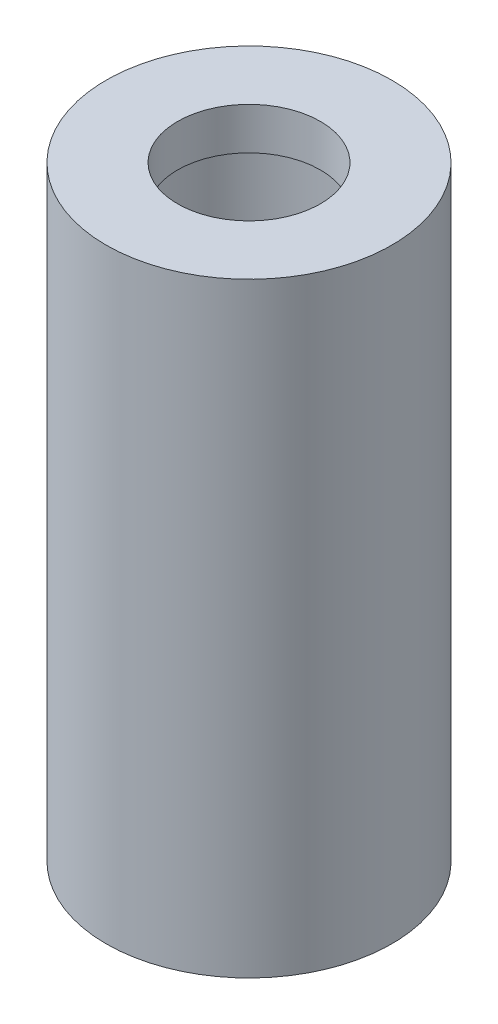
ISO-10303-21;
HEADER;
FILE_DESCRIPTION(('STEP AP214'),'2;1');
FILE_NAME('part.step','',(''),(''),'','','');
FILE_SCHEMA(('AUTOMOTIVE_DESIGN { 1 0 10303 214 1 1 1 1 }'));
ENDSEC;
DATA;
#1=APPLICATION_CONTEXT('core data for automotive mechanical design processes');
#2=APPLICATION_PROTOCOL_DEFINITION('international standard','automotive_design',2000,#1);
#3=PRODUCT_CONTEXT('',#1,'mechanical');
#4=PRODUCT('Part','Part','',(#3));
#5=PRODUCT_RELATED_PRODUCT_CATEGORY('part','',(#4));
#6=PRODUCT_DEFINITION_FORMATION('','',#4);
#7=PRODUCT_DEFINITION_CONTEXT('part definition',#1,'design');
#8=PRODUCT_DEFINITION('design','',#6,#7);
#9=PRODUCT_DEFINITION_SHAPE('','',#8);
#10=(LENGTH_UNIT() NAMED_UNIT(*) SI_UNIT(.MILLI.,.METRE.));
#11=(NAMED_UNIT(*) PLANE_ANGLE_UNIT() SI_UNIT($,.RADIAN.));
#12=(NAMED_UNIT(*) SI_UNIT($,.STERADIAN.) SOLID_ANGLE_UNIT());
#13=UNCERTAINTY_MEASURE_WITH_UNIT(LENGTH_MEASURE(1.E-05),#10,'distance_accuracy_value','');
#14=(GEOMETRIC_REPRESENTATION_CONTEXT(3) GLOBAL_UNCERTAINTY_ASSIGNED_CONTEXT((#13)) GLOBAL_UNIT_ASSIGNED_CONTEXT((#10,
#11,#12)) REPRESENTATION_CONTEXT('',''));
#15=CARTESIAN_POINT('',(0.,0.,0.));
#16=DIRECTION('',(0.,0.,1.));
#17=DIRECTION('',(1.,0.,0.));
#18=AXIS2_PLACEMENT_3D('',#15,#16,#17);
#19=CARTESIAN_POINT('',(0.,0.,0.));
#20=DIRECTION('',(0.,-1.,0.));
#21=DIRECTION('',(0.,0.,-1.));
#22=AXIS2_PLACEMENT_3D('',#19,#20,#21);
#23=CYLINDRICAL_SURFACE('',#22,4.318);
#24=CARTESIAN_POINT('',(0.,10.16,-4.318));
#25=CARTESIAN_POINT('',(0.107564996094003,10.1599939960877,-4.31799493700134));
#26=CARTESIAN_POINT('',(0.215280063258811,10.1514086647514,-4.31393656109449));
#27=CARTESIAN_POINT('',(0.427573036527433,10.1174252545205,-4.29810362143442));
#28=CARTESIAN_POINT('',(0.532143582591965,10.0919905222087,-4.28631223620757));
#29=CARTESIAN_POINT('',(0.734744660391047,10.0254975786058,-4.25625706788956));
#30=CARTESIAN_POINT('',(0.832797975199767,9.98449756788832,-4.23801741297071));
#31=CARTESIAN_POINT('',(1.02051085954431,9.88831627299821,-4.19677614463367));
#32=CARTESIAN_POINT('',(1.11017174440845,9.8331372161726,-4.17377527925105));
#33=CARTESIAN_POINT('',(1.28414734314053,9.70666633308327,-4.12367951380002));
#34=CARTESIAN_POINT('',(1.36789070455287,9.63465121864839,-4.09642839845823));
#35=CARTESIAN_POINT('',(1.52262602006949,9.47809677140521,-4.04147115133817));
#36=CARTESIAN_POINT('',(1.59360943141755,9.39354911668146,-4.01376472817753));
#37=CARTESIAN_POINT('',(1.72552717339445,9.20754818690793,-3.95892929484532));
#38=CARTESIAN_POINT('',(1.7854773720292,9.1053440102564,-3.93196163651535));
#39=CARTESIAN_POINT('',(1.88708667274111,8.89087705779825,-3.88422472935619));
#40=CARTESIAN_POINT('',(1.92875762400245,8.77862085503702,-3.86345146792904));
#41=CARTESIAN_POINT('',(1.99011493887881,8.55375286853101,-3.83219249604893));
#42=CARTESIAN_POINT('',(2.0109081250063,8.44151780447618,-3.82119290154902));
#43=CARTESIAN_POINT('',(2.03334173849922,8.2146560064079,-3.809307672583));
#44=CARTESIAN_POINT('',(2.03499751483782,8.10003126295059,-3.80841393282696));
#45=CARTESIAN_POINT('',(2.01992784930827,7.88429015104647,-3.81641935289164));
#46=CARTESIAN_POINT('',(2.00507628735512,7.78299745598531,-3.82432029483131));
#47=CARTESIAN_POINT('',(1.96062178676057,7.5845573925372,-3.84729849193661));
#48=CARTESIAN_POINT('',(1.93101496353401,7.48741112308625,-3.86237763684504));
#49=CARTESIAN_POINT('',(1.85731338514925,7.29730708472795,-3.89836102841066));
#50=CARTESIAN_POINT('',(1.81289931207698,7.20449820294967,-3.91939196254706));
#51=CARTESIAN_POINT('',(1.71107931588595,7.02723140048811,-3.96490068968397));
#52=CARTESIAN_POINT('',(1.65366768648658,6.94277717119627,-3.98937999482454));
#53=CARTESIAN_POINT('',(1.52005799065391,6.77478094662394,-4.04230824533155));
#54=CARTESIAN_POINT('',(1.4424842747245,6.69237339964082,-4.07089675776891));
#55=CARTESIAN_POINT('',(1.27443019166955,6.54129773258328,-4.12659504063025));
#56=CARTESIAN_POINT('',(1.18394496608462,6.47263480793559,-4.15370424907583));
#57=CARTESIAN_POINT('',(0.988371076162724,6.34866641538429,-4.20461802105592));
#58=CARTESIAN_POINT('',(0.882867703369781,6.29394511869164,-4.22826436758175));
#59=CARTESIAN_POINT('',(0.66275471125039,6.2034451135497,-4.26829654873372));
#60=CARTESIAN_POINT('',(0.548151592165333,6.16765302090504,-4.2846875120537));
#61=CARTESIAN_POINT('',(0.322456820120241,6.11868453218039,-4.30732135774457));
#62=CARTESIAN_POINT('',(0.211762078811778,6.10399381475204,-4.31424182912819));
#63=CARTESIAN_POINT('',(-0.0107221192577917,6.09298180188201,-4.31941782070158));
#64=CARTESIAN_POINT('',(-0.122511123429953,6.09665320770651,-4.31767678374325));
#65=CARTESIAN_POINT('',(-0.336094809160397,6.1212990069179,-4.30614070075398));
#66=CARTESIAN_POINT('',(-0.43805815964547,6.14110073726453,-4.29689163672836));
#67=CARTESIAN_POINT('',(-0.637044497748703,6.19568374466052,-4.27192685115026));
#68=CARTESIAN_POINT('',(-0.734066909602079,6.23046676302472,-4.25621037788311));
#69=CARTESIAN_POINT('',(-0.92380247385651,6.31506491914881,-4.21916418563295));
#70=CARTESIAN_POINT('',(-1.0162941223267,6.36530594786198,-4.19767796647096));
#71=CARTESIAN_POINT('',(-1.19186009927102,6.47892750923329,-4.15124717066001));
#72=CARTESIAN_POINT('',(-1.27493026814233,6.54231381089352,-4.12630107719029));
#73=CARTESIAN_POINT('',(-1.43711777415552,6.68697559250523,-4.07280523522967));
#74=CARTESIAN_POINT('',(-1.51522402110019,6.76934158054756,-4.04413241712159));
#75=CARTESIAN_POINT('',(-1.65690075820137,6.9462410539145,-3.98818483365197));
#76=CARTESIAN_POINT('',(-1.72046396650967,7.04078059780103,-3.96091077394251));
#77=CARTESIAN_POINT('',(-1.83321096410232,7.2435437273083,-3.91004187226364));
#78=CARTESIAN_POINT('',(-1.88182956558768,7.35212436950423,-3.88660448373372));
#79=CARTESIAN_POINT('',(-1.95959609474898,7.57739721965339,-3.84798954709838));
#80=CARTESIAN_POINT('',(-1.98876600180283,7.6940801057981,-3.8328026785154));
#81=CARTESIAN_POINT('',(-2.024365991721,7.92083761392558,-3.81410984107844));
#82=CARTESIAN_POINT('',(-2.03262361017406,8.03054753198225,-3.80966679169984));
#83=CARTESIAN_POINT('',(-2.03130337745915,8.2498131983759,-3.81037214759556));
#84=CARTESIAN_POINT('',(-2.02173079169853,8.35936898266883,-3.81551772127007));
#85=CARTESIAN_POINT('',(-1.98667636785656,8.56658082564855,-3.83387271773897));
#86=CARTESIAN_POINT('',(-1.96244724358528,8.66451161793325,-3.84644551756347));
#87=CARTESIAN_POINT('',(-1.90019105015951,8.85486537072883,-3.87757684186368));
#88=CARTESIAN_POINT('',(-1.8621598436195,8.94728667000263,-3.89613716100445));
#89=CARTESIAN_POINT('',(-1.77050985226195,9.13075913714984,-3.93867082597709));
#90=CARTESIAN_POINT('',(-1.7160226134899,9.2213103987938,-3.96292207747039));
#91=CARTESIAN_POINT('',(-1.59405430858161,9.39254599614916,-4.01353620723032));
#92=CARTESIAN_POINT('',(-1.52656707557385,9.47322561918205,-4.03990008419331));
#93=CARTESIAN_POINT('',(-1.37234993492437,9.6310179407821,-4.09501467747263));
#94=CARTESIAN_POINT('',(-1.28435545387417,9.70691277266711,-4.12373236567742));
#95=CARTESIAN_POINT('',(-1.09595464301873,9.84305441547222,-4.17775062508293));
#96=CARTESIAN_POINT('',(-0.995542378363646,9.90329370112545,-4.2030495501673));
#97=CARTESIAN_POINT('',(-0.785153159420695,10.005817249747,-4.24737171802493));
#98=CARTESIAN_POINT('',(-0.675217165362312,10.0481742116097,-4.26642029915691));
#99=CARTESIAN_POINT('',(-0.448797360372564,10.113294740842,-4.29611950060487));
#100=CARTESIAN_POINT('',(-0.332334044713147,10.1361163378388,-4.30679498516315));
#101=CARTESIAN_POINT('',(-0.179095685139983,10.152411814187,-4.31443390417931));
#102=CARTESIAN_POINT('',(-0.143354175924427,10.1552541950461,-4.31576842880261));
#103=CARTESIAN_POINT('',(-0.0717473461259999,10.1590493095224,-4.31755233062712));
#104=CARTESIAN_POINT('',(-0.0358820229172087,10.1600020028125,-4.31800168893823));
#105=CARTESIAN_POINT('',(0.,10.16,-4.318));
#106=B_SPLINE_CURVE_WITH_KNOTS('',3,(#24,#25,#26,#27,#28,#29,#30,#31,#32,#33,#34,#35,#36,#37,
#38,#39,#40,#41,#42,#43,#44,#45,#46,#47,#48,#49,#50,#51,#52,#53,#54,#55,#56,#57,#58,#59,#60,#61,
#62,#63,#64,#65,#66,#67,#68,#69,#70,#71,#72,#73,#74,#75,#76,#77,#78,#79,#80,#81,#82,#83,#84,#85,
#86,#87,#88,#89,#90,#91,#92,#93,#94,#95,#96,#97,#98,#99,#100,#101,#102,#103,#104,#105),
.UNSPECIFIED.,.T.,.F.,(4,2,2,2,2,2,2,2,2,2,2,2,2,2,2,2,2,2,2,2,2,2,2,2,2,2,2,2,2,2,2,2,2,2,2,2,
2,2,2,2,4),(0.,0.32254846684513,0.645800905144513,0.967856379231305,1.28986129341131,
1.62970508978123,1.96977557018109,2.33249495447047,2.69497886390578,3.0370303111089,
3.37880740022451,3.68541591861875,3.99210519983742,4.30588941064899,4.61981164933118,
4.96846138812248,5.31724266765533,5.67885210213351,6.04020551190461,6.37404842659705,
6.70775865310094,7.01916876990524,7.33061509250568,7.65155493667927,7.97263592936504,
8.32231521575717,8.67216920883114,9.03397074932527,9.39536271410128,9.7238728285382,
10.0522859465911,10.3559606668612,10.6597264935721,10.9836945797874,11.3078167285026,
11.6652357513411,12.0228262609809,12.3789486850412,12.7340095428163,12.8416044381476,
12.9492016296088),.UNSPECIFIED.);
#107=CARTESIAN_POINT('',(0.,10.16,-4.318));
#108=VERTEX_POINT('',#107);
#109=EDGE_CURVE('E73',#108,#108,#106,.T.);
#110=ORIENTED_EDGE('',*,*,#109,.F.);
#111=EDGE_LOOP('',(#110));
#112=FACE_BOUND('',#111,.T.);
#113=CARTESIAN_POINT('',(0.,18.288,0.));
#114=DIRECTION('',(0.,-1.,0.));
#115=DIRECTION('',(0.,0.,-1.));
#116=AXIS2_PLACEMENT_3D('',#113,#114,#115);
#117=CIRCLE('',#116,4.318);
#118=CARTESIAN_POINT('',(0.,18.288,-4.318));
#119=VERTEX_POINT('',#118);
#120=EDGE_CURVE('E70',#119,#119,#117,.T.);
#121=ORIENTED_EDGE('',*,*,#120,.T.);
#122=EDGE_LOOP('',(#121));
#123=FACE_BOUND('',#122,.T.);
#124=CARTESIAN_POINT('',(0.,0.,0.));
#125=DIRECTION('',(0.,-1.,0.));
#126=DIRECTION('',(0.,0.,-1.));
#127=AXIS2_PLACEMENT_3D('',#124,#125,#126);
#128=CIRCLE('',#127,4.318);
#129=CARTESIAN_POINT('',(0.,0.,-4.318));
#130=VERTEX_POINT('',#129);
#131=EDGE_CURVE('E10',#130,#130,#128,.T.);
#132=ORIENTED_EDGE('',*,*,#131,.F.);
#133=EDGE_LOOP('',(#132));
#134=FACE_BOUND('',#133,.T.);
#135=ADVANCED_FACE('F36',(#112,#123,#134),#23,.T.);
#136=CARTESIAN_POINT('',(3.175,0.,0.));
#137=DIRECTION('',(0.,-1.,0.));
#138=DIRECTION('',(0.,0.,-1.));
#139=AXIS2_PLACEMENT_3D('',#136,#137,#138);
#140=PLANE('',#139);
#141=ORIENTED_EDGE('',*,*,#131,.T.);
#142=EDGE_LOOP('',(#141));
#143=FACE_BOUND('',#142,.T.);
#144=CARTESIAN_POINT('',(0.,0.,0.));
#145=DIRECTION('',(0.,-1.,0.));
#146=DIRECTION('',(0.,0.,-1.));
#147=AXIS2_PLACEMENT_3D('',#144,#145,#146);
#148=CIRCLE('',#147,3.175);
#149=CARTESIAN_POINT('',(0.,0.,-3.175));
#150=VERTEX_POINT('',#149);
#151=EDGE_CURVE('E49',#150,#150,#148,.T.);
#152=ORIENTED_EDGE('',*,*,#151,.F.);
#153=EDGE_LOOP('',(#152));
#154=FACE_BOUND('',#153,.T.);
#155=ADVANCED_FACE('F106',(#143,#154),#140,.T.);
#156=CARTESIAN_POINT('',(0.,0.,0.));
#157=DIRECTION('',(0.,-1.,0.));
#158=DIRECTION('',(0.,0.,-1.));
#159=AXIS2_PLACEMENT_3D('',#156,#157,#158);
#160=CYLINDRICAL_SURFACE('',#159,3.175);
#161=CARTESIAN_POINT('',(0.,10.16,-3.175));
#162=CARTESIAN_POINT('',(-0.102802091998547,10.1599913633981,-3.17499204317214));
#163=CARTESIAN_POINT('',(-0.205712967083934,10.1521457873225,-3.16995556613701));
#164=CARTESIAN_POINT('',(-0.408345945914438,10.1211950960444,-3.15028428681525));
#165=CARTESIAN_POINT('',(-0.508062450647399,10.0980645764118,-3.13563350529892));
#166=CARTESIAN_POINT('',(-0.70099187155182,10.0379204585669,-3.09820061555947));
#167=CARTESIAN_POINT('',(-0.794234443207303,10.0009759080209,-3.07545897543814));
#168=CARTESIAN_POINT('',(-0.972850708349812,9.91473802420151,-3.02371392471125));
#169=CARTESIAN_POINT('',(-1.0582248651087,9.86544541858576,-2.99471088309727));
#170=CARTESIAN_POINT('',(-1.22657617751479,9.75148371501817,-2.93000295258297));
#171=CARTESIAN_POINT('',(-1.30878643385331,9.6858868427974,-2.89394397085769));
#172=CARTESIAN_POINT('',(-1.46177780864565,9.54333864805653,-2.81976531709181));
#173=CARTESIAN_POINT('',(-1.53254282535195,9.46637161553581,-2.7816428408765));
#174=CARTESIAN_POINT('',(-1.67097750324061,9.29038447212942,-2.70106343805628));
#175=CARTESIAN_POINT('',(-1.73674918752875,9.18978466519014,-2.65876858107147));
#176=CARTESIAN_POINT('',(-1.8502950828519,8.97650577978671,-2.58104184987292));
#177=CARTESIAN_POINT('',(-1.89810016623102,8.86384785308725,-2.5455982543951));
#178=CARTESIAN_POINT('',(-1.96306433169842,8.66046429639481,-2.4956381564288));
#179=CARTESIAN_POINT('',(-1.9850125820552,8.57202760489964,-2.47805527375041));
#180=CARTESIAN_POINT('',(-2.01688234158149,8.3917386678011,-2.45219187814505));
#181=CARTESIAN_POINT('',(-2.02682213142594,8.29989183379602,-2.4438972270032));
#182=CARTESIAN_POINT('',(-2.03406844238957,8.11505410651243,-2.43787169233307));
#183=CARTESIAN_POINT('',(-2.03133590853695,8.02206055854128,-2.44017346588101));
#184=CARTESIAN_POINT('',(-2.01334074881702,7.8381026586568,-2.45503753256747));
#185=CARTESIAN_POINT('',(-1.99806778439992,7.7471400446613,-2.46760829159312));
#186=CARTESIAN_POINT('',(-1.95654400964381,7.57229811014925,-2.50064563775483));
#187=CARTESIAN_POINT('',(-1.9306337193207,7.48828851150307,-2.52086589880531));
#188=CARTESIAN_POINT('',(-1.86892073645816,7.32567059288816,-2.56695150673926));
#189=CARTESIAN_POINT('',(-1.83311475787166,7.24706407795992,-2.59281872820029));
#190=CARTESIAN_POINT('',(-1.74468379478224,7.08131336100032,-2.65331736310943));
#191=CARTESIAN_POINT('',(-1.69014547028028,6.99545677503548,-2.68867632216134));
#192=CARTESIAN_POINT('',(-1.56927250704524,6.83313916380197,-2.76097453557637));
#193=CARTESIAN_POINT('',(-1.50292389187166,6.75668945404597,-2.79791562247838));
#194=CARTESIAN_POINT('',(-1.34609593842544,6.60111772627783,-2.87709972256472));
#195=CARTESIAN_POINT('',(-1.25342255447502,6.52405017917204,-2.91908129280469));
#196=CARTESIAN_POINT('',(-1.05412916945486,6.38660960949182,-2.99680453367646));
#197=CARTESIAN_POINT('',(-0.94752424885656,6.32621875184342,-3.03255285532205));
#198=CARTESIAN_POINT('',(-0.745027149764212,6.23492520177162,-3.08776548970284));
#199=CARTESIAN_POINT('',(-0.651197489087397,6.20055065629353,-3.1090528487167));
#200=CARTESIAN_POINT('',(-0.458101923285714,6.14577533612908,-3.14330309554202));
#201=CARTESIAN_POINT('',(-0.358840457318063,6.12536332941108,-3.15627267398738));
#202=CARTESIAN_POINT('',(-0.157245856062999,6.09953868029836,-3.17272053168039));
#203=CARTESIAN_POINT('',(-0.0549035728236163,6.09417633771128,-3.1761669816173));
#204=CARTESIAN_POINT('',(0.149278703587831,6.0989196104325,-3.17313166741519));
#205=CARTESIAN_POINT('',(0.25111866692885,6.10902613354727,-3.16664932059437));
#206=CARTESIAN_POINT('',(0.445777818959475,6.14316829751541,-3.14499563248384));
#207=CARTESIAN_POINT('',(0.538788771098942,6.16643504963934,-3.13030442711357));
#208=CARTESIAN_POINT('',(0.719347665233573,6.22521653048865,-3.09380938215554));
#209=CARTESIAN_POINT('',(0.806894685878681,6.2607333183098,-3.07200434684486));
#210=CARTESIAN_POINT('',(0.981221766727693,6.34577570321343,-3.02103940447064));
#211=CARTESIAN_POINT('',(1.06746270490706,6.39614534539221,-2.99145375338782));
#212=CARTESIAN_POINT('',(1.23068208252937,6.50804520937202,-2.92809272901181));
#213=CARTESIAN_POINT('',(1.3076532592485,6.5695840886868,-2.89431411212649));
#214=CARTESIAN_POINT('',(1.46249777618801,6.71276756104019,-2.81960831865929));
#215=CARTESIAN_POINT('',(1.53871535620921,6.79604730459113,-2.77837700931998));
#216=CARTESIAN_POINT('',(1.67667876113208,6.97452784822472,-2.69736409760926));
#217=CARTESIAN_POINT('',(1.73842174216536,7.06973098530492,-2.65758278141684));
#218=CARTESIAN_POINT('',(1.83860127108378,7.25721567173573,-2.58908117678437));
#219=CARTESIAN_POINT('',(1.87906802456759,7.3481247111273,-2.5595922960966));
#220=CARTESIAN_POINT('',(1.94668410344127,7.53684767352877,-2.50855535607173));
#221=CARTESIAN_POINT('',(1.9738519198636,7.63465179166822,-2.48699628145415));
#222=CARTESIAN_POINT('',(2.01355343863443,7.83604891585482,-2.45497691549338));
#223=CARTESIAN_POINT('',(2.02594703301665,7.93968773374163,-2.44462296914143));
#224=CARTESIAN_POINT('',(2.03456932369405,8.14807747312286,-2.43745721220956));
#225=CARTESIAN_POINT('',(2.03080975414351,8.25282753221585,-2.44063557133222));
#226=CARTESIAN_POINT('',(2.00920052708875,8.44433689683274,-2.45842888308435));
#227=CARTESIAN_POINT('',(1.99345832476193,8.53151435291493,-2.47133063315083));
#228=CARTESIAN_POINT('',(1.95129345000781,8.70174173100004,-2.50475552346759));
#229=CARTESIAN_POINT('',(1.92486018861993,8.78478746889456,-2.52528621816378));
#230=CARTESIAN_POINT('',(1.85150505892116,8.97322749869929,-2.5797835060279));
#231=CARTESIAN_POINT('',(1.80066154830889,9.07645847678801,-2.61594204524788));
#232=CARTESIAN_POINT('',(1.68340470154152,9.27176007319649,-2.69289797773704));
#233=CARTESIAN_POINT('',(1.61697034257883,9.36381536557618,-2.73370159586912));
#234=CARTESIAN_POINT('',(1.46896419567041,9.53663266794724,-2.81602892763037));
#235=CARTESIAN_POINT('',(1.3872233421231,9.61724890274908,-2.85755546234148));
#236=CARTESIAN_POINT('',(1.2102578529011,9.76432103597823,-2.93688941547999));
#237=CARTESIAN_POINT('',(1.11503295365481,9.83077665754551,-2.9746967611842));
#238=CARTESIAN_POINT('',(0.909208281521364,9.94922011770739,-3.04402026615375));
#239=CARTESIAN_POINT('',(0.798216844579389,10.000682604789,-3.07529902946536));
#240=CARTESIAN_POINT('',(0.624671888714858,10.062578034638,-3.11350948741009));
#241=CARTESIAN_POINT('',(0.565696104007327,10.0806519630244,-3.12478960261631));
#242=CARTESIAN_POINT('',(0.445862263086728,10.1114432699623,-3.14412176120682));
#243=CARTESIAN_POINT('',(0.385005554336101,10.1241643918859,-3.1521760603069));
#244=CARTESIAN_POINT('',(0.270237202187769,10.142673629406,-3.16393226692449));
#245=CARTESIAN_POINT('',(0.216481903631259,10.1491601665947,-3.16807141413581));
#246=CARTESIAN_POINT('',(0.108494513180754,10.1578256799388,-3.17360741161958));
#247=CARTESIAN_POINT('',(0.0542624105331577,10.1600045586897,-3.17500419988204));
#248=CARTESIAN_POINT('',(0.,10.16,-3.175));
#249=B_SPLINE_CURVE_WITH_KNOTS('',3,(#161,#162,#163,#164,#165,#166,#167,#168,#169,#170,#171,
#172,#173,#174,#175,#176,#177,#178,#179,#180,#181,#182,#183,#184,#185,#186,#187,#188,#189,#190,
#191,#192,#193,#194,#195,#196,#197,#198,#199,#200,#201,#202,#203,#204,#205,#206,#207,#208,#209,
#210,#211,#212,#213,#214,#215,#216,#217,#218,#219,#220,#221,#222,#223,#224,#225,#226,#227,#228,
#229,#230,#231,#232,#233,#234,#235,#236,#237,#238,#239,#240,#241,#242,#243,#244,#245,#246,#247,
#248),.UNSPECIFIED.,.T.,.F.,(4,2,2,2,2,2,2,2,2,2,2,2,2,2,2,2,2,2,2,2,2,2,2,2,2,2,2,2,2,2,2,2,2,
2,2,2,2,2,2,2,2,2,2,4),(0.,0.308188490220293,0.61689049962424,0.924069691420599,
1.23123078573352,1.56350950346237,1.89625169633383,2.27669378606605,2.6564791333267,
2.93374298249309,3.21058421437262,3.48827921224912,3.76620337686525,4.03584967492173,
4.30558562185004,4.62747173688218,4.94974133945158,5.33077293129879,5.71139543237299,
6.01660273138245,6.32156421962704,6.6275437598663,6.93354125752154,7.22327486627296,
7.51305719979868,7.8243458298038,8.1358767847956,8.49496144237971,8.85411659140032,
9.16428665602469,9.47402422204033,9.78667632231663,10.0991013409219,10.3665263656191,
10.6342169126375,10.9941767437131,11.3546247645709,11.7193179516068,12.0840182682565,
12.4602784565965,12.6481152194758,12.8358204034848,12.9984890022022,13.161161279126),.UNSPECIFIED.);
#250=CARTESIAN_POINT('',(0.,10.16,-3.175));
#251=VERTEX_POINT('',#250);
#252=EDGE_CURVE('E40',#251,#251,#249,.T.);
#253=ORIENTED_EDGE('',*,*,#252,.F.);
#254=EDGE_LOOP('',(#253));
#255=FACE_BOUND('',#254,.T.);
#256=ORIENTED_EDGE('',*,*,#151,.T.);
#257=EDGE_LOOP('',(#256));
#258=FACE_BOUND('',#257,.T.);
#259=CARTESIAN_POINT('',(0.,12.7,0.));
#260=DIRECTION('',(0.,-1.,0.));
#261=DIRECTION('',(0.,0.,-1.));
#262=AXIS2_PLACEMENT_3D('',#259,#260,#261);
#263=CIRCLE('',#262,3.175);
#264=CARTESIAN_POINT('',(0.,12.7,-3.175));
#265=VERTEX_POINT('',#264);
#266=EDGE_CURVE('E53',#265,#265,#263,.T.);
#267=ORIENTED_EDGE('',*,*,#266,.F.);
#268=EDGE_LOOP('',(#267));
#269=FACE_BOUND('',#268,.T.);
#270=ADVANCED_FACE('F102',(#255,#258,#269),#160,.F.);
#271=CARTESIAN_POINT('',(2.921,12.7,0.));
#272=DIRECTION('',(0.,-1.,0.));
#273=DIRECTION('',(0.,0.,-1.));
#274=AXIS2_PLACEMENT_3D('',#271,#272,#273);
#275=PLANE('',#274);
#276=ORIENTED_EDGE('',*,*,#266,.T.);
#277=EDGE_LOOP('',(#276));
#278=FACE_BOUND('',#277,.T.);
#279=CARTESIAN_POINT('',(0.,12.7,0.));
#280=DIRECTION('',(0.,-1.,0.));
#281=DIRECTION('',(0.,0.,-1.));
#282=AXIS2_PLACEMENT_3D('',#279,#280,#281);
#283=CIRCLE('',#282,2.921);
#284=CARTESIAN_POINT('',(0.,12.7,-2.921));
#285=VERTEX_POINT('',#284);
#286=EDGE_CURVE('E58',#285,#285,#283,.T.);
#287=ORIENTED_EDGE('',*,*,#286,.F.);
#288=EDGE_LOOP('',(#287));
#289=FACE_BOUND('',#288,.T.);
#290=ADVANCED_FACE('F99',(#278,#289),#275,.T.);
#291=CARTESIAN_POINT('',(0.,0.,0.));
#292=DIRECTION('',(0.,-1.,0.));
#293=DIRECTION('',(0.,0.,-1.));
#294=AXIS2_PLACEMENT_3D('',#291,#292,#293);
#295=CYLINDRICAL_SURFACE('',#294,2.921);
#296=ORIENTED_EDGE('',*,*,#286,.T.);
#297=EDGE_LOOP('',(#296));
#298=FACE_BOUND('',#297,.T.);
#299=CARTESIAN_POINT('',(0.,17.018,0.));
#300=DIRECTION('',(0.,-1.,0.));
#301=DIRECTION('',(0.,0.,-1.));
#302=AXIS2_PLACEMENT_3D('',#299,#300,#301);
#303=CIRCLE('',#302,2.921);
#304=CARTESIAN_POINT('',(0.,17.018,-2.921));
#305=VERTEX_POINT('',#304);
#306=EDGE_CURVE('E61',#305,#305,#303,.T.);
#307=ORIENTED_EDGE('',*,*,#306,.F.);
#308=EDGE_LOOP('',(#307));
#309=FACE_BOUND('',#308,.T.);
#310=ADVANCED_FACE('F95',(#298,#309),#295,.F.);
#311=CARTESIAN_POINT('',(2.159,17.018,0.));
#312=DIRECTION('',(0.,-1.,0.));
#313=DIRECTION('',(0.,0.,-1.));
#314=AXIS2_PLACEMENT_3D('',#311,#312,#313);
#315=PLANE('',#314);
#316=ORIENTED_EDGE('',*,*,#306,.T.);
#317=EDGE_LOOP('',(#316));
#318=FACE_BOUND('',#317,.T.);
#319=CARTESIAN_POINT('',(0.,17.018,0.));
#320=DIRECTION('',(0.,-1.,0.));
#321=DIRECTION('',(0.,0.,-1.));
#322=AXIS2_PLACEMENT_3D('',#319,#320,#321);
#323=CIRCLE('',#322,2.159);
#324=CARTESIAN_POINT('',(0.,17.018,-2.159));
#325=VERTEX_POINT('',#324);
#326=EDGE_CURVE('E64',#325,#325,#323,.T.);
#327=ORIENTED_EDGE('',*,*,#326,.F.);
#328=EDGE_LOOP('',(#327));
#329=FACE_BOUND('',#328,.T.);
#330=ADVANCED_FACE('F91',(#318,#329),#315,.T.);
#331=CARTESIAN_POINT('',(0.,0.,0.));
#332=DIRECTION('',(0.,-1.,0.));
#333=DIRECTION('',(0.,0.,-1.));
#334=AXIS2_PLACEMENT_3D('',#331,#332,#333);
#335=CYLINDRICAL_SURFACE('',#334,2.159);
#336=ORIENTED_EDGE('',*,*,#326,.T.);
#337=EDGE_LOOP('',(#336));
#338=FACE_BOUND('',#337,.T.);
#339=CARTESIAN_POINT('',(0.,18.288,0.));
#340=DIRECTION('',(0.,-1.,0.));
#341=DIRECTION('',(0.,0.,-1.));
#342=AXIS2_PLACEMENT_3D('',#339,#340,#341);
#343=CIRCLE('',#342,2.159);
#344=CARTESIAN_POINT('',(0.,18.288,-2.159));
#345=VERTEX_POINT('',#344);
#346=EDGE_CURVE('E67',#345,#345,#343,.T.);
#347=ORIENTED_EDGE('',*,*,#346,.F.);
#348=EDGE_LOOP('',(#347));
#349=FACE_BOUND('',#348,.T.);
#350=ADVANCED_FACE('F87',(#338,#349),#335,.F.);
#351=CARTESIAN_POINT('',(2.159,18.288,0.));
#352=DIRECTION('',(0.,1.,0.));
#353=DIRECTION('',(0.,0.,1.));
#354=AXIS2_PLACEMENT_3D('',#351,#352,#353);
#355=PLANE('',#354);
#356=ORIENTED_EDGE('',*,*,#346,.T.);
#357=EDGE_LOOP('',(#356));
#358=FACE_BOUND('',#357,.T.);
#359=ORIENTED_EDGE('',*,*,#120,.F.);
#360=EDGE_LOOP('',(#359));
#361=FACE_BOUND('',#360,.T.);
#362=ADVANCED_FACE('F82',(#358,#361),#355,.T.);
#363=CARTESIAN_POINT('',(0.,8.128,-4.318));
#364=DIRECTION('',(0.,0.,1.));
#365=DIRECTION('',(1.,0.,0.));
#366=AXIS2_PLACEMENT_3D('',#363,#364,#365);
#367=CYLINDRICAL_SURFACE('',#366,2.032);
#368=ORIENTED_EDGE('',*,*,#109,.T.);
#369=EDGE_LOOP('',(#368));
#370=FACE_BOUND('',#369,.T.);
#371=ORIENTED_EDGE('',*,*,#252,.T.);
#372=EDGE_LOOP('',(#371));
#373=FACE_BOUND('',#372,.T.);
#374=ADVANCED_FACE('F78',(#370,#373),#367,.F.);
#375=CLOSED_SHELL('',(#135,#155,#270,#290,#310,#330,#350,#362,#374));
#376=MANIFOLD_SOLID_BREP('B2',#375);
#377=ADVANCED_BREP_SHAPE_REPRESENTATION('',(#18,#376),#14);
#378=SHAPE_DEFINITION_REPRESENTATION(#9,#377);
ENDSEC;
END-ISO-10303-21;
